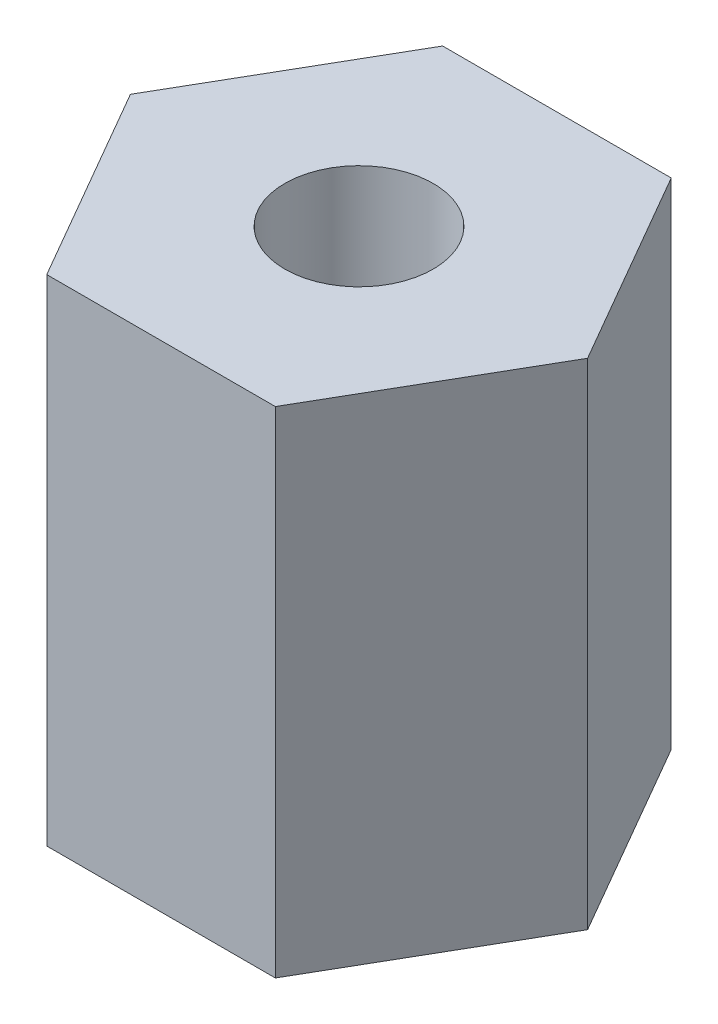
ISO-10303-21;
HEADER;
FILE_DESCRIPTION(('STEP AP214'),'2;1');
FILE_NAME('part.step','',(''),(''),'','','');
FILE_SCHEMA(('AUTOMOTIVE_DESIGN { 1 0 10303 214 1 1 1 1 }'));
ENDSEC;
DATA;
#1=APPLICATION_CONTEXT('core data for automotive mechanical design processes');
#2=APPLICATION_PROTOCOL_DEFINITION('international standard','automotive_design',2000,#1);
#3=PRODUCT_CONTEXT('',#1,'mechanical');
#4=PRODUCT('Part','Part','',(#3));
#5=PRODUCT_RELATED_PRODUCT_CATEGORY('part','',(#4));
#6=PRODUCT_DEFINITION_FORMATION('','',#4);
#7=PRODUCT_DEFINITION_CONTEXT('part definition',#1,'design');
#8=PRODUCT_DEFINITION('design','',#6,#7);
#9=PRODUCT_DEFINITION_SHAPE('','',#8);
#10=(LENGTH_UNIT() NAMED_UNIT(*) SI_UNIT(.MILLI.,.METRE.));
#11=(NAMED_UNIT(*) PLANE_ANGLE_UNIT() SI_UNIT($,.RADIAN.));
#12=(NAMED_UNIT(*) SI_UNIT($,.STERADIAN.) SOLID_ANGLE_UNIT());
#13=UNCERTAINTY_MEASURE_WITH_UNIT(LENGTH_MEASURE(1.E-05),#10,'distance_accuracy_value','');
#14=(GEOMETRIC_REPRESENTATION_CONTEXT(3) GLOBAL_UNCERTAINTY_ASSIGNED_CONTEXT((#13)) GLOBAL_UNIT_ASSIGNED_CONTEXT((#10,
#11,#12)) REPRESENTATION_CONTEXT('',''));
#15=CARTESIAN_POINT('',(0.,0.,0.));
#16=DIRECTION('',(0.,0.,1.));
#17=DIRECTION('',(1.,0.,0.));
#18=AXIS2_PLACEMENT_3D('',#15,#16,#17);
#19=CARTESIAN_POINT('',(0.,10.,0.));
#20=DIRECTION('',(0.,1.,0.));
#21=DIRECTION('',(0.,0.,1.));
#22=AXIS2_PLACEMENT_3D('',#19,#20,#21);
#23=PLANE('',#22);
#24=DIRECTION('',(0.5,0.,-0.866025403784438));
#25=VECTOR('',#24,1.);
#26=CARTESIAN_POINT('',(2.3094010767585,10.,4.));
#27=LINE('',#26,#25);
#28=CARTESIAN_POINT('',(2.3094010767585,10.,4.));
#29=VERTEX_POINT('',#28);
#30=CARTESIAN_POINT('',(4.61880215351701,10.,0.));
#31=VERTEX_POINT('',#30);
#32=EDGE_CURVE('E146',#29,#31,#27,.T.);
#33=ORIENTED_EDGE('',*,*,#32,.T.);
#34=DIRECTION('',(-0.5,0.,-0.866025403784438));
#35=VECTOR('',#34,1.);
#36=CARTESIAN_POINT('',(4.61880215351701,10.,0.));
#37=LINE('',#36,#35);
#38=CARTESIAN_POINT('',(2.3094010767585,10.,-4.));
#39=VERTEX_POINT('',#38);
#40=EDGE_CURVE('E94',#31,#39,#37,.T.);
#41=ORIENTED_EDGE('',*,*,#40,.T.);
#42=DIRECTION('',(-1.,0.,0.));
#43=VECTOR('',#42,1.);
#44=CARTESIAN_POINT('',(2.3094010767585,10.,-4.));
#45=LINE('',#44,#43);
#46=CARTESIAN_POINT('',(-2.3094010767585,10.,-4.));
#47=VERTEX_POINT('',#46);
#48=EDGE_CURVE('E107',#39,#47,#45,.T.);
#49=ORIENTED_EDGE('',*,*,#48,.T.);
#50=DIRECTION('',(-0.5,0.,0.866025403784439));
#51=VECTOR('',#50,1.);
#52=CARTESIAN_POINT('',(-2.3094010767585,10.,-4.));
#53=LINE('',#52,#51);
#54=CARTESIAN_POINT('',(-4.61880215351701,10.,0.));
#55=VERTEX_POINT('',#54);
#56=EDGE_CURVE('E101',#47,#55,#53,.T.);
#57=ORIENTED_EDGE('',*,*,#56,.T.);
#58=DIRECTION('',(0.5,0.,0.866025403784439));
#59=VECTOR('',#58,1.);
#60=CARTESIAN_POINT('',(-4.61880215351701,10.,0.));
#61=LINE('',#60,#59);
#62=CARTESIAN_POINT('',(-2.3094010767585,10.,4.));
#63=VERTEX_POINT('',#62);
#64=EDGE_CURVE('E105',#55,#63,#61,.T.);
#65=ORIENTED_EDGE('',*,*,#64,.T.);
#66=DIRECTION('',(1.,0.,0.));
#67=VECTOR('',#66,1.);
#68=CARTESIAN_POINT('',(-2.3094010767585,10.,4.));
#69=LINE('',#68,#67);
#70=EDGE_CURVE('E57',#63,#29,#69,.T.);
#71=ORIENTED_EDGE('',*,*,#70,.T.);
#72=EDGE_LOOP('',(#33,#41,#49,#57,#65,#71));
#73=FACE_BOUND('',#72,.T.);
#74=CARTESIAN_POINT('',(0.,10.,0.));
#75=DIRECTION('',(0.,1.,0.));
#76=DIRECTION('',(0.,0.,1.));
#77=AXIS2_PLACEMENT_3D('',#74,#75,#76);
#78=CIRCLE('',#77,1.5);
#79=CARTESIAN_POINT('',(0.,10.,1.5));
#80=VERTEX_POINT('',#79);
#81=EDGE_CURVE('E134',#80,#80,#78,.T.);
#82=ORIENTED_EDGE('',*,*,#81,.F.);
#83=EDGE_LOOP('',(#82));
#84=FACE_BOUND('',#83,.T.);
#85=ADVANCED_FACE('F39',(#73,#84),#23,.T.);
#86=CARTESIAN_POINT('',(0.,0.,0.));
#87=DIRECTION('',(0.,1.,0.));
#88=DIRECTION('',(0.,0.,1.));
#89=AXIS2_PLACEMENT_3D('',#86,#87,#88);
#90=PLANE('',#89);
#91=DIRECTION('',(0.5,0.,-0.866025403784438));
#92=VECTOR('',#91,1.);
#93=CARTESIAN_POINT('',(2.3094010767585,0.,4.));
#94=LINE('',#93,#92);
#95=CARTESIAN_POINT('',(2.3094010767585,0.,4.));
#96=VERTEX_POINT('',#95);
#97=CARTESIAN_POINT('',(4.61880215351701,0.,0.));
#98=VERTEX_POINT('',#97);
#99=EDGE_CURVE('E129',#96,#98,#94,.T.);
#100=ORIENTED_EDGE('',*,*,#99,.F.);
#101=DIRECTION('',(1.,0.,0.));
#102=VECTOR('',#101,1.);
#103=CARTESIAN_POINT('',(-2.3094010767585,0.,4.));
#104=LINE('',#103,#102);
#105=CARTESIAN_POINT('',(-2.3094010767585,0.,4.));
#106=VERTEX_POINT('',#105);
#107=EDGE_CURVE('E86',#106,#96,#104,.T.);
#108=ORIENTED_EDGE('',*,*,#107,.F.);
#109=DIRECTION('',(0.5,0.,0.866025403784439));
#110=VECTOR('',#109,1.);
#111=CARTESIAN_POINT('',(-4.61880215351701,0.,0.));
#112=LINE('',#111,#110);
#113=CARTESIAN_POINT('',(-4.61880215351701,0.,0.));
#114=VERTEX_POINT('',#113);
#115=EDGE_CURVE('E80',#114,#106,#112,.T.);
#116=ORIENTED_EDGE('',*,*,#115,.F.);
#117=DIRECTION('',(-0.5,0.,0.866025403784439));
#118=VECTOR('',#117,1.);
#119=CARTESIAN_POINT('',(-2.3094010767585,0.,-4.));
#120=LINE('',#119,#118);
#121=CARTESIAN_POINT('',(-2.3094010767585,0.,-4.));
#122=VERTEX_POINT('',#121);
#123=EDGE_CURVE('E116',#122,#114,#120,.T.);
#124=ORIENTED_EDGE('',*,*,#123,.F.);
#125=DIRECTION('',(-1.,0.,0.));
#126=VECTOR('',#125,1.);
#127=CARTESIAN_POINT('',(2.3094010767585,0.,-4.));
#128=LINE('',#127,#126);
#129=CARTESIAN_POINT('',(2.3094010767585,0.,-4.));
#130=VERTEX_POINT('',#129);
#131=EDGE_CURVE('E137',#130,#122,#128,.T.);
#132=ORIENTED_EDGE('',*,*,#131,.F.);
#133=DIRECTION('',(-0.5,0.,-0.866025403784438));
#134=VECTOR('',#133,1.);
#135=CARTESIAN_POINT('',(4.61880215351701,0.,0.));
#136=LINE('',#135,#134);
#137=EDGE_CURVE('E133',#98,#130,#136,.T.);
#138=ORIENTED_EDGE('',*,*,#137,.F.);
#139=EDGE_LOOP('',(#100,#108,#116,#124,#132,#138));
#140=FACE_BOUND('',#139,.T.);
#141=CARTESIAN_POINT('',(0.,0.,0.));
#142=DIRECTION('',(0.,1.,0.));
#143=DIRECTION('',(0.,0.,1.));
#144=AXIS2_PLACEMENT_3D('',#141,#142,#143);
#145=CIRCLE('',#144,1.5);
#146=CARTESIAN_POINT('',(0.,0.,1.5));
#147=VERTEX_POINT('',#146);
#148=EDGE_CURVE('E243',#147,#147,#145,.T.);
#149=ORIENTED_EDGE('',*,*,#148,.T.);
#150=EDGE_LOOP('',(#149));
#151=FACE_BOUND('',#150,.T.);
#152=ADVANCED_FACE('F159',(#140,#151),#90,.F.);
#153=CARTESIAN_POINT('',(2.3094010767585,10.,4.));
#154=DIRECTION('',(-0.866025403784438,0.,-0.5));
#155=DIRECTION('',(-0.5,0.,0.866025403784439));
#156=AXIS2_PLACEMENT_3D('',#153,#154,#155);
#157=PLANE('',#156);
#158=ORIENTED_EDGE('',*,*,#99,.T.);
#159=DIRECTION('',(0.,-1.,0.));
#160=VECTOR('',#159,1.);
#161=CARTESIAN_POINT('',(4.61880215351701,10.,0.));
#162=LINE('',#161,#160);
#163=EDGE_CURVE('E11',#31,#98,#162,.T.);
#164=ORIENTED_EDGE('',*,*,#163,.F.);
#165=ORIENTED_EDGE('',*,*,#32,.F.);
#166=DIRECTION('',(0.,-1.,0.));
#167=VECTOR('',#166,1.);
#168=CARTESIAN_POINT('',(2.3094010767585,10.,4.));
#169=LINE('',#168,#167);
#170=EDGE_CURVE('E125',#29,#96,#169,.T.);
#171=ORIENTED_EDGE('',*,*,#170,.T.);
#172=EDGE_LOOP('',(#158,#164,#165,#171));
#173=FACE_BOUND('',#172,.T.);
#174=ADVANCED_FACE('F41',(#173),#157,.F.);
#175=CARTESIAN_POINT('',(4.61880215351701,10.,0.));
#176=DIRECTION('',(-0.866025403784438,0.,0.5));
#177=DIRECTION('',(0.5,0.,0.866025403784439));
#178=AXIS2_PLACEMENT_3D('',#175,#176,#177);
#179=PLANE('',#178);
#180=ORIENTED_EDGE('',*,*,#137,.T.);
#181=DIRECTION('',(0.,-1.,0.));
#182=VECTOR('',#181,1.);
#183=CARTESIAN_POINT('',(2.3094010767585,10.,-4.));
#184=LINE('',#183,#182);
#185=EDGE_CURVE('E49',#39,#130,#184,.T.);
#186=ORIENTED_EDGE('',*,*,#185,.F.);
#187=ORIENTED_EDGE('',*,*,#40,.F.);
#188=ORIENTED_EDGE('',*,*,#163,.T.);
#189=EDGE_LOOP('',(#180,#186,#187,#188));
#190=FACE_BOUND('',#189,.T.);
#191=ADVANCED_FACE('F184',(#190),#179,.F.);
#192=CARTESIAN_POINT('',(2.3094010767585,10.,-4.));
#193=DIRECTION('',(0.,0.,1.));
#194=DIRECTION('',(1.,0.,0.));
#195=AXIS2_PLACEMENT_3D('',#192,#193,#194);
#196=PLANE('',#195);
#197=ORIENTED_EDGE('',*,*,#131,.T.);
#198=DIRECTION('',(0.,-1.,0.));
#199=VECTOR('',#198,1.);
#200=CARTESIAN_POINT('',(-2.3094010767585,10.,-4.));
#201=LINE('',#200,#199);
#202=EDGE_CURVE('E118',#47,#122,#201,.T.);
#203=ORIENTED_EDGE('',*,*,#202,.F.);
#204=ORIENTED_EDGE('',*,*,#48,.F.);
#205=ORIENTED_EDGE('',*,*,#185,.T.);
#206=EDGE_LOOP('',(#197,#203,#204,#205));
#207=FACE_BOUND('',#206,.T.);
#208=ADVANCED_FACE('F156',(#207),#196,.F.);
#209=CARTESIAN_POINT('',(-2.3094010767585,10.,-4.));
#210=DIRECTION('',(0.866025403784439,0.,0.5));
#211=DIRECTION('',(0.5,0.,-0.866025403784439));
#212=AXIS2_PLACEMENT_3D('',#209,#210,#211);
#213=PLANE('',#212);
#214=ORIENTED_EDGE('',*,*,#123,.T.);
#215=DIRECTION('',(0.,-1.,0.));
#216=VECTOR('',#215,1.);
#217=CARTESIAN_POINT('',(-4.61880215351701,10.,0.));
#218=LINE('',#217,#216);
#219=EDGE_CURVE('E113',#55,#114,#218,.T.);
#220=ORIENTED_EDGE('',*,*,#219,.F.);
#221=ORIENTED_EDGE('',*,*,#56,.F.);
#222=ORIENTED_EDGE('',*,*,#202,.T.);
#223=EDGE_LOOP('',(#214,#220,#221,#222));
#224=FACE_BOUND('',#223,.T.);
#225=ADVANCED_FACE('F114',(#224),#213,.F.);
#226=CARTESIAN_POINT('',(-4.61880215351701,10.,0.));
#227=DIRECTION('',(0.866025403784439,0.,-0.5));
#228=DIRECTION('',(-0.5,0.,-0.866025403784439));
#229=AXIS2_PLACEMENT_3D('',#226,#227,#228);
#230=PLANE('',#229);
#231=ORIENTED_EDGE('',*,*,#115,.T.);
#232=DIRECTION('',(0.,-1.,0.));
#233=VECTOR('',#232,1.);
#234=CARTESIAN_POINT('',(-2.3094010767585,10.,4.));
#235=LINE('',#234,#233);
#236=EDGE_CURVE('E119',#63,#106,#235,.T.);
#237=ORIENTED_EDGE('',*,*,#236,.F.);
#238=ORIENTED_EDGE('',*,*,#64,.F.);
#239=ORIENTED_EDGE('',*,*,#219,.T.);
#240=EDGE_LOOP('',(#231,#237,#238,#239));
#241=FACE_BOUND('',#240,.T.);
#242=ADVANCED_FACE('F121',(#241),#230,.F.);
#243=CARTESIAN_POINT('',(-2.3094010767585,10.,4.));
#244=DIRECTION('',(0.,0.,-1.));
#245=DIRECTION('',(-1.,0.,0.));
#246=AXIS2_PLACEMENT_3D('',#243,#244,#245);
#247=PLANE('',#246);
#248=ORIENTED_EDGE('',*,*,#107,.T.);
#249=ORIENTED_EDGE('',*,*,#170,.F.);
#250=ORIENTED_EDGE('',*,*,#70,.F.);
#251=ORIENTED_EDGE('',*,*,#236,.T.);
#252=EDGE_LOOP('',(#248,#249,#250,#251));
#253=FACE_BOUND('',#252,.T.);
#254=ADVANCED_FACE('F164',(#253),#247,.F.);
#255=CARTESIAN_POINT('',(0.,10.,0.));
#256=DIRECTION('',(0.,-1.,0.));
#257=DIRECTION('',(0.,0.,-1.));
#258=AXIS2_PLACEMENT_3D('',#255,#256,#257);
#259=CYLINDRICAL_SURFACE('',#258,1.5);
#260=ORIENTED_EDGE('',*,*,#81,.T.);
#261=EDGE_LOOP('',(#260));
#262=FACE_BOUND('',#261,.T.);
#263=ORIENTED_EDGE('',*,*,#148,.F.);
#264=EDGE_LOOP('',(#263));
#265=FACE_BOUND('',#264,.T.);
#266=ADVANCED_FACE('F166',(#262,#265),#259,.F.);
#267=CLOSED_SHELL('',(#85,#152,#174,#191,#208,#225,#242,#254,#266));
#268=MANIFOLD_SOLID_BREP('B2',#267);
#269=ADVANCED_BREP_SHAPE_REPRESENTATION('',(#18,#268),#14);
#270=SHAPE_DEFINITION_REPRESENTATION(#9,#269);
ENDSEC;
END-ISO-10303-21;
